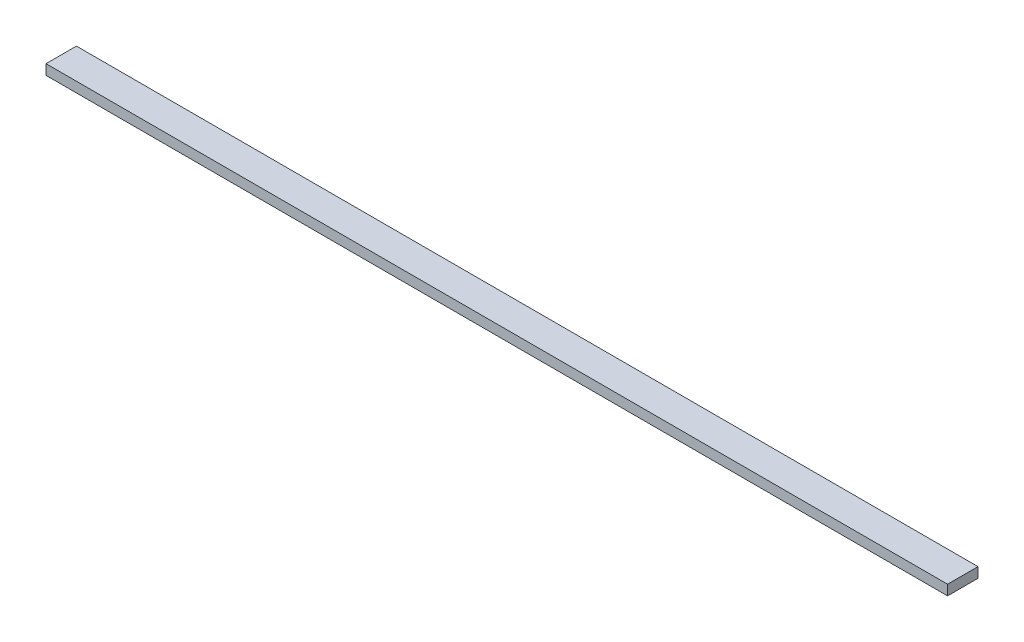
ISO-10303-21;
HEADER;
FILE_DESCRIPTION(('STEP AP214'),'2;1');
FILE_NAME('part.step','',(''),(''),'','','');
FILE_SCHEMA(('AUTOMOTIVE_DESIGN { 1 0 10303 214 1 1 1 1 }'));
ENDSEC;
DATA;
#1=APPLICATION_CONTEXT('core data for automotive mechanical design processes');
#2=APPLICATION_PROTOCOL_DEFINITION('international standard','automotive_design',2000,#1);
#3=PRODUCT_CONTEXT('',#1,'mechanical');
#4=PRODUCT('Part','Part','',(#3));
#5=PRODUCT_RELATED_PRODUCT_CATEGORY('part','',(#4));
#6=PRODUCT_DEFINITION_FORMATION('','',#4);
#7=PRODUCT_DEFINITION_CONTEXT('part definition',#1,'design');
#8=PRODUCT_DEFINITION('design','',#6,#7);
#9=PRODUCT_DEFINITION_SHAPE('','',#8);
#10=(LENGTH_UNIT() NAMED_UNIT(*) SI_UNIT(.MILLI.,.METRE.));
#11=(NAMED_UNIT(*) PLANE_ANGLE_UNIT() SI_UNIT($,.RADIAN.));
#12=(NAMED_UNIT(*) SI_UNIT($,.STERADIAN.) SOLID_ANGLE_UNIT());
#13=UNCERTAINTY_MEASURE_WITH_UNIT(LENGTH_MEASURE(1.E-05),#10,'distance_accuracy_value','');
#14=(GEOMETRIC_REPRESENTATION_CONTEXT(3) GLOBAL_UNCERTAINTY_ASSIGNED_CONTEXT((#13)) GLOBAL_UNIT_ASSIGNED_CONTEXT((#10,
#11,#12)) REPRESENTATION_CONTEXT('',''));
#15=CARTESIAN_POINT('',(0.,0.,0.));
#16=DIRECTION('',(0.,0.,1.));
#17=DIRECTION('',(1.,0.,0.));
#18=AXIS2_PLACEMENT_3D('',#15,#16,#17);
#19=CARTESIAN_POINT('',(-444.265,10.,-15.));
#20=DIRECTION('',(1.,0.,0.));
#21=DIRECTION('',(0.,0.,-1.));
#22=AXIS2_PLACEMENT_3D('',#19,#20,#21);
#23=PLANE('',#22);
#24=DIRECTION('',(0.,0.,1.));
#25=VECTOR('',#24,1.);
#26=CARTESIAN_POINT('',(-444.265,0.,-15.));
#27=LINE('',#26,#25);
#28=CARTESIAN_POINT('',(-444.265,0.,-15.));
#29=VERTEX_POINT('',#28);
#30=CARTESIAN_POINT('',(-444.265,0.,15.));
#31=VERTEX_POINT('',#30);
#32=EDGE_CURVE('E97',#29,#31,#27,.T.);
#33=ORIENTED_EDGE('',*,*,#32,.T.);
#34=DIRECTION('',(0.,-1.,0.));
#35=VECTOR('',#34,1.);
#36=CARTESIAN_POINT('',(-444.265,10.,15.));
#37=LINE('',#36,#35);
#38=CARTESIAN_POINT('',(-444.265,10.,15.));
#39=VERTEX_POINT('',#38);
#40=EDGE_CURVE('E11',#39,#31,#37,.T.);
#41=ORIENTED_EDGE('',*,*,#40,.F.);
#42=DIRECTION('',(0.,0.,1.));
#43=VECTOR('',#42,1.);
#44=CARTESIAN_POINT('',(-444.265,10.,-15.));
#45=LINE('',#44,#43);
#46=CARTESIAN_POINT('',(-444.265,10.,-15.));
#47=VERTEX_POINT('',#46);
#48=EDGE_CURVE('E85',#47,#39,#45,.T.);
#49=ORIENTED_EDGE('',*,*,#48,.F.);
#50=DIRECTION('',(0.,-1.,0.));
#51=VECTOR('',#50,1.);
#52=CARTESIAN_POINT('',(-444.265,10.,-15.));
#53=LINE('',#52,#51);
#54=EDGE_CURVE('E93',#47,#29,#53,.T.);
#55=ORIENTED_EDGE('',*,*,#54,.T.);
#56=EDGE_LOOP('',(#33,#41,#49,#55));
#57=FACE_BOUND('',#56,.T.);
#58=ADVANCED_FACE('F34',(#57),#23,.F.);
#59=CARTESIAN_POINT('',(-444.265,10.,15.));
#60=DIRECTION('',(0.,0.,-1.));
#61=DIRECTION('',(-1.,0.,0.));
#62=AXIS2_PLACEMENT_3D('',#59,#60,#61);
#63=PLANE('',#62);
#64=DIRECTION('',(1.,0.,0.));
#65=VECTOR('',#64,1.);
#66=CARTESIAN_POINT('',(-444.265,0.,15.));
#67=LINE('',#66,#65);
#68=CARTESIAN_POINT('',(444.265,0.,15.));
#69=VERTEX_POINT('',#68);
#70=EDGE_CURVE('E89',#31,#69,#67,.T.);
#71=ORIENTED_EDGE('',*,*,#70,.T.);
#72=DIRECTION('',(0.,-1.,0.));
#73=VECTOR('',#72,1.);
#74=CARTESIAN_POINT('',(444.265,10.,15.));
#75=LINE('',#74,#73);
#76=CARTESIAN_POINT('',(444.265,10.,15.));
#77=VERTEX_POINT('',#76);
#78=EDGE_CURVE('E42',#77,#69,#75,.T.);
#79=ORIENTED_EDGE('',*,*,#78,.F.);
#80=DIRECTION('',(1.,0.,0.));
#81=VECTOR('',#80,1.);
#82=CARTESIAN_POINT('',(-444.265,10.,15.));
#83=LINE('',#82,#81);
#84=EDGE_CURVE('E80',#39,#77,#83,.T.);
#85=ORIENTED_EDGE('',*,*,#84,.F.);
#86=ORIENTED_EDGE('',*,*,#40,.T.);
#87=EDGE_LOOP('',(#71,#79,#85,#86));
#88=FACE_BOUND('',#87,.T.);
#89=ADVANCED_FACE('F88',(#88),#63,.F.);
#90=CARTESIAN_POINT('',(444.265,10.,-15.));
#91=DIRECTION('',(-1.,0.,0.));
#92=DIRECTION('',(0.,0.,1.));
#93=AXIS2_PLACEMENT_3D('',#90,#91,#92);
#94=PLANE('',#93);
#95=DIRECTION('',(0.,0.,-1.));
#96=VECTOR('',#95,1.);
#97=CARTESIAN_POINT('',(444.265,0.,-15.));
#98=LINE('',#97,#96);
#99=CARTESIAN_POINT('',(444.265,0.,-15.));
#100=VERTEX_POINT('',#99);
#101=EDGE_CURVE('E67',#69,#100,#98,.T.);
#102=ORIENTED_EDGE('',*,*,#101,.T.);
#103=DIRECTION('',(0.,-1.,0.));
#104=VECTOR('',#103,1.);
#105=CARTESIAN_POINT('',(444.265,10.,-15.));
#106=LINE('',#105,#104);
#107=CARTESIAN_POINT('',(444.265,10.,-15.));
#108=VERTEX_POINT('',#107);
#109=EDGE_CURVE('E90',#108,#100,#106,.T.);
#110=ORIENTED_EDGE('',*,*,#109,.F.);
#111=DIRECTION('',(0.,0.,-1.));
#112=VECTOR('',#111,1.);
#113=CARTESIAN_POINT('',(444.265,10.,-15.));
#114=LINE('',#113,#112);
#115=EDGE_CURVE('E83',#77,#108,#114,.T.);
#116=ORIENTED_EDGE('',*,*,#115,.F.);
#117=ORIENTED_EDGE('',*,*,#78,.T.);
#118=EDGE_LOOP('',(#102,#110,#116,#117));
#119=FACE_BOUND('',#118,.T.);
#120=ADVANCED_FACE('F91',(#119),#94,.F.);
#121=CARTESIAN_POINT('',(-444.265,10.,-15.));
#122=DIRECTION('',(0.,0.,1.));
#123=DIRECTION('',(1.,0.,0.));
#124=AXIS2_PLACEMENT_3D('',#121,#122,#123);
#125=PLANE('',#124);
#126=DIRECTION('',(-1.,0.,0.));
#127=VECTOR('',#126,1.);
#128=CARTESIAN_POINT('',(-444.265,0.,-15.));
#129=LINE('',#128,#127);
#130=EDGE_CURVE('E73',#100,#29,#129,.T.);
#131=ORIENTED_EDGE('',*,*,#130,.T.);
#132=ORIENTED_EDGE('',*,*,#54,.F.);
#133=DIRECTION('',(-1.,0.,0.));
#134=VECTOR('',#133,1.);
#135=CARTESIAN_POINT('',(-444.265,10.,-15.));
#136=LINE('',#135,#134);
#137=EDGE_CURVE('E50',#108,#47,#136,.T.);
#138=ORIENTED_EDGE('',*,*,#137,.F.);
#139=ORIENTED_EDGE('',*,*,#109,.T.);
#140=EDGE_LOOP('',(#131,#132,#138,#139));
#141=FACE_BOUND('',#140,.T.);
#142=ADVANCED_FACE('F104',(#141),#125,.F.);
#143=CARTESIAN_POINT('',(0.,10.,0.));
#144=DIRECTION('',(0.,1.,0.));
#145=DIRECTION('',(0.,0.,1.));
#146=AXIS2_PLACEMENT_3D('',#143,#144,#145);
#147=PLANE('',#146);
#148=ORIENTED_EDGE('',*,*,#48,.T.);
#149=ORIENTED_EDGE('',*,*,#84,.T.);
#150=ORIENTED_EDGE('',*,*,#115,.T.);
#151=ORIENTED_EDGE('',*,*,#137,.T.);
#152=EDGE_LOOP('',(#148,#149,#150,#151));
#153=FACE_BOUND('',#152,.T.);
#154=ADVANCED_FACE('F81',(#153),#147,.T.);
#155=CARTESIAN_POINT('',(0.,0.,0.));
#156=DIRECTION('',(0.,1.,0.));
#157=DIRECTION('',(0.,0.,1.));
#158=AXIS2_PLACEMENT_3D('',#155,#156,#157);
#159=PLANE('',#158);
#160=ORIENTED_EDGE('',*,*,#32,.F.);
#161=ORIENTED_EDGE('',*,*,#130,.F.);
#162=ORIENTED_EDGE('',*,*,#101,.F.);
#163=ORIENTED_EDGE('',*,*,#70,.F.);
#164=EDGE_LOOP('',(#160,#161,#162,#163));
#165=FACE_BOUND('',#164,.T.);
#166=ADVANCED_FACE('F107',(#165),#159,.F.);
#167=CLOSED_SHELL('',(#58,#89,#120,#142,#154,#166));
#168=MANIFOLD_SOLID_BREP('B2',#167);
#169=ADVANCED_BREP_SHAPE_REPRESENTATION('',(#18,#168),#14);
#170=SHAPE_DEFINITION_REPRESENTATION(#9,#169);
ENDSEC;
END-ISO-10303-21;
